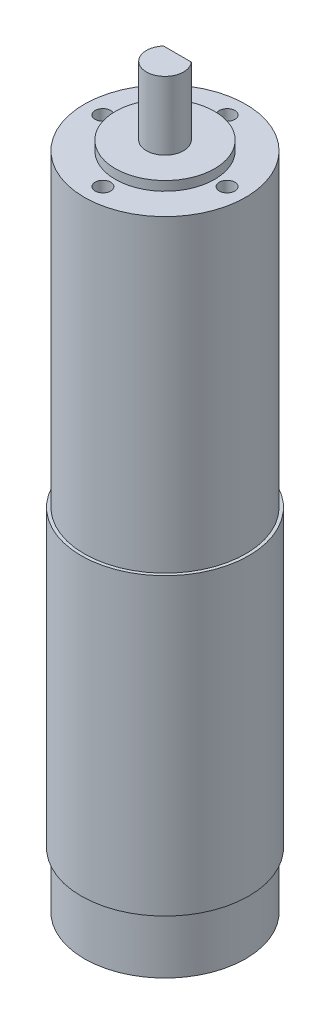
ISO-10303-21;
HEADER;
FILE_DESCRIPTION(('STEP AP214'),'2;1');
FILE_NAME('part.step','',(''),(''),'','','');
FILE_SCHEMA(('AUTOMOTIVE_DESIGN { 1 0 10303 214 1 1 1 1 }'));
ENDSEC;
DATA;
#1=APPLICATION_CONTEXT('core data for automotive mechanical design processes');
#2=APPLICATION_PROTOCOL_DEFINITION('international standard','automotive_design',2000,#1);
#3=PRODUCT_CONTEXT('',#1,'mechanical');
#4=PRODUCT('Part','Part','',(#3));
#5=PRODUCT_RELATED_PRODUCT_CATEGORY('part','',(#4));
#6=PRODUCT_DEFINITION_FORMATION('','',#4);
#7=PRODUCT_DEFINITION_CONTEXT('part definition',#1,'design');
#8=PRODUCT_DEFINITION('design','',#6,#7);
#9=PRODUCT_DEFINITION_SHAPE('','',#8);
#10=(LENGTH_UNIT() NAMED_UNIT(*) SI_UNIT(.MILLI.,.METRE.));
#11=(NAMED_UNIT(*) PLANE_ANGLE_UNIT() SI_UNIT($,.RADIAN.));
#12=(NAMED_UNIT(*) SI_UNIT($,.STERADIAN.) SOLID_ANGLE_UNIT());
#13=UNCERTAINTY_MEASURE_WITH_UNIT(LENGTH_MEASURE(1.E-05),#10,'distance_accuracy_value','');
#14=(GEOMETRIC_REPRESENTATION_CONTEXT(3) GLOBAL_UNCERTAINTY_ASSIGNED_CONTEXT((#13)) GLOBAL_UNIT_ASSIGNED_CONTEXT((#10,
#11,#12)) REPRESENTATION_CONTEXT('',''));
#15=CARTESIAN_POINT('',(0.,0.,0.));
#16=DIRECTION('',(0.,0.,1.));
#17=DIRECTION('',(1.,0.,0.));
#18=AXIS2_PLACEMENT_3D('',#15,#16,#17);
#19=CARTESIAN_POINT('',(0.,0.,0.));
#20=DIRECTION('',(0.,1.,0.));
#21=DIRECTION('',(0.,0.,1.));
#22=AXIS2_PLACEMENT_3D('',#19,#20,#21);
#23=PLANE('',#22);
#24=CARTESIAN_POINT('',(0.,0.,0.));
#25=DIRECTION('',(0.,1.,0.));
#26=DIRECTION('',(0.,0.,1.));
#27=AXIS2_PLACEMENT_3D('',#24,#25,#26);
#28=CIRCLE('',#27,27.);
#29=CARTESIAN_POINT('',(0.,0.,27.));
#30=VERTEX_POINT('',#29);
#31=EDGE_CURVE('E90',#30,#30,#28,.T.);
#32=ORIENTED_EDGE('',*,*,#31,.F.);
#33=EDGE_LOOP('',(#32));
#34=FACE_BOUND('',#33,.T.);
#35=CARTESIAN_POINT('',(0.,0.,0.));
#36=DIRECTION('',(0.,1.,0.));
#37=DIRECTION('',(0.,0.,1.));
#38=AXIS2_PLACEMENT_3D('',#35,#36,#37);
#39=CIRCLE('',#38,26.);
#40=CARTESIAN_POINT('',(0.,0.,26.));
#41=VERTEX_POINT('',#40);
#42=EDGE_CURVE('E11',#41,#41,#39,.F.);
#43=ORIENTED_EDGE('',*,*,#42,.F.);
#44=EDGE_LOOP('',(#43));
#45=FACE_BOUND('',#44,.T.);
#46=ADVANCED_FACE('F33',(#34,#45),#23,.F.);
#47=CARTESIAN_POINT('',(0.,197.5,0.));
#48=DIRECTION('',(0.,1.,0.));
#49=DIRECTION('',(0.,0.,1.));
#50=AXIS2_PLACEMENT_3D('',#47,#48,#49);
#51=PLANE('',#50);
#52=CARTESIAN_POINT('',(0.,197.5,0.));
#53=DIRECTION('',(0.,1.,0.));
#54=DIRECTION('',(0.,0.,1.));
#55=AXIS2_PLACEMENT_3D('',#52,#53,#54);
#56=CIRCLE('',#55,16.);
#57=CARTESIAN_POINT('',(0.,197.5,16.));
#58=VERTEX_POINT('',#57);
#59=EDGE_CURVE('E78',#58,#58,#56,.T.);
#60=ORIENTED_EDGE('',*,*,#59,.T.);
#61=EDGE_LOOP('',(#60));
#62=FACE_BOUND('',#61,.T.);
#63=CARTESIAN_POINT('',(0.,197.5,0.));
#64=DIRECTION('',(0.,1.,0.));
#65=DIRECTION('',(0.,0.,1.));
#66=AXIS2_PLACEMENT_3D('',#63,#64,#65);
#67=CIRCLE('',#66,6.);
#68=CARTESIAN_POINT('',(0.,197.5,6.));
#69=VERTEX_POINT('',#68);
#70=EDGE_CURVE('E72',#69,#69,#67,.T.);
#71=ORIENTED_EDGE('',*,*,#70,.F.);
#72=EDGE_LOOP('',(#71));
#73=FACE_BOUND('',#72,.T.);
#74=ADVANCED_FACE('F100',(#62,#73),#51,.T.);
#75=CARTESIAN_POINT('',(0.,194.5,0.));
#76=DIRECTION('',(0.,1.,0.));
#77=DIRECTION('',(0.,0.,1.));
#78=AXIS2_PLACEMENT_3D('',#75,#76,#77);
#79=PLANE('',#78);
#80=CARTESIAN_POINT('',(20.,194.5,0.));
#81=DIRECTION('',(0.,1.,0.));
#82=DIRECTION('',(0.,0.,1.));
#83=AXIS2_PLACEMENT_3D('',#80,#81,#82);
#84=CIRCLE('',#83,2.5);
#85=CARTESIAN_POINT('',(20.,194.5,2.5));
#86=VERTEX_POINT('',#85);
#87=EDGE_CURVE('E315',#86,#86,#84,.T.);
#88=ORIENTED_EDGE('',*,*,#87,.F.);
#89=EDGE_LOOP('',(#88));
#90=FACE_BOUND('',#89,.T.);
#91=CARTESIAN_POINT('',(0.,194.5,20.));
#92=DIRECTION('',(0.,1.,0.));
#93=DIRECTION('',(0.,0.,1.));
#94=AXIS2_PLACEMENT_3D('',#91,#92,#93);
#95=CIRCLE('',#94,2.5);
#96=CARTESIAN_POINT('',(0.,194.5,22.5));
#97=VERTEX_POINT('',#96);
#98=EDGE_CURVE('E319',#97,#97,#95,.T.);
#99=ORIENTED_EDGE('',*,*,#98,.F.);
#100=EDGE_LOOP('',(#99));
#101=FACE_BOUND('',#100,.T.);
#102=CARTESIAN_POINT('',(-20.,194.5,0.));
#103=DIRECTION('',(0.,1.,0.));
#104=DIRECTION('',(0.,0.,1.));
#105=AXIS2_PLACEMENT_3D('',#102,#103,#104);
#106=CIRCLE('',#105,2.5);
#107=CARTESIAN_POINT('',(-20.,194.5,2.5));
#108=VERTEX_POINT('',#107);
#109=EDGE_CURVE('E323',#108,#108,#106,.T.);
#110=ORIENTED_EDGE('',*,*,#109,.F.);
#111=EDGE_LOOP('',(#110));
#112=FACE_BOUND('',#111,.T.);
#113=CARTESIAN_POINT('',(0.,194.5,-20.));
#114=DIRECTION('',(0.,1.,0.));
#115=DIRECTION('',(0.,0.,1.));
#116=AXIS2_PLACEMENT_3D('',#113,#114,#115);
#117=CIRCLE('',#116,2.5);
#118=CARTESIAN_POINT('',(0.,194.5,-17.5));
#119=VERTEX_POINT('',#118);
#120=EDGE_CURVE('E326',#119,#119,#117,.T.);
#121=ORIENTED_EDGE('',*,*,#120,.F.);
#122=EDGE_LOOP('',(#121));
#123=FACE_BOUND('',#122,.T.);
#124=CARTESIAN_POINT('',(0.,194.5,0.));
#125=DIRECTION('',(0.,1.,0.));
#126=DIRECTION('',(0.,0.,1.));
#127=AXIS2_PLACEMENT_3D('',#124,#125,#126);
#128=CIRCLE('',#127,26.);
#129=CARTESIAN_POINT('',(0.,194.5,26.));
#130=VERTEX_POINT('',#129);
#131=EDGE_CURVE('E87',#130,#130,#128,.T.);
#132=ORIENTED_EDGE('',*,*,#131,.T.);
#133=EDGE_LOOP('',(#132));
#134=FACE_BOUND('',#133,.T.);
#135=CARTESIAN_POINT('',(0.,194.5,0.));
#136=DIRECTION('',(0.,1.,0.));
#137=DIRECTION('',(0.,0.,1.));
#138=AXIS2_PLACEMENT_3D('',#135,#136,#137);
#139=CIRCLE('',#138,16.);
#140=CARTESIAN_POINT('',(0.,194.5,16.));
#141=VERTEX_POINT('',#140);
#142=EDGE_CURVE('E75',#141,#141,#139,.T.);
#143=ORIENTED_EDGE('',*,*,#142,.F.);
#144=EDGE_LOOP('',(#143));
#145=FACE_BOUND('',#144,.T.);
#146=ADVANCED_FACE('F160',(#90,#101,#112,#123,#134,#145),#79,.T.);
#147=CARTESIAN_POINT('',(0.,95.,0.));
#148=DIRECTION('',(0.,1.,0.));
#149=DIRECTION('',(0.,0.,1.));
#150=AXIS2_PLACEMENT_3D('',#147,#148,#149);
#151=PLANE('',#150);
#152=CARTESIAN_POINT('',(0.,95.,0.));
#153=DIRECTION('',(0.,1.,0.));
#154=DIRECTION('',(0.,0.,1.));
#155=AXIS2_PLACEMENT_3D('',#152,#153,#154);
#156=CIRCLE('',#155,27.);
#157=CARTESIAN_POINT('',(0.,95.,27.));
#158=VERTEX_POINT('',#157);
#159=EDGE_CURVE('E41',#158,#158,#156,.T.);
#160=ORIENTED_EDGE('',*,*,#159,.T.);
#161=EDGE_LOOP('',(#160));
#162=FACE_BOUND('',#161,.T.);
#163=CARTESIAN_POINT('',(0.,95.,0.));
#164=DIRECTION('',(0.,1.,0.));
#165=DIRECTION('',(0.,0.,1.));
#166=AXIS2_PLACEMENT_3D('',#163,#164,#165);
#167=CIRCLE('',#166,26.);
#168=CARTESIAN_POINT('',(0.,95.,26.));
#169=VERTEX_POINT('',#168);
#170=EDGE_CURVE('E85',#169,#169,#167,.T.);
#171=ORIENTED_EDGE('',*,*,#170,.F.);
#172=EDGE_LOOP('',(#171));
#173=FACE_BOUND('',#172,.T.);
#174=ADVANCED_FACE('F168',(#162,#173),#151,.T.);
#175=CARTESIAN_POINT('',(0.,95.,0.));
#176=DIRECTION('',(0.,-1.,0.));
#177=DIRECTION('',(0.,0.,-1.));
#178=AXIS2_PLACEMENT_3D('',#175,#176,#177);
#179=CYLINDRICAL_SURFACE('',#178,27.);
#180=ORIENTED_EDGE('',*,*,#159,.F.);
#181=EDGE_LOOP('',(#180));
#182=FACE_BOUND('',#181,.T.);
#183=ORIENTED_EDGE('',*,*,#31,.T.);
#184=EDGE_LOOP('',(#183));
#185=FACE_BOUND('',#184,.T.);
#186=ADVANCED_FACE('F35',(#182,#185),#179,.T.);
#187=CARTESIAN_POINT('',(0.,194.5,0.));
#188=DIRECTION('',(0.,-1.,0.));
#189=DIRECTION('',(0.,0.,-1.));
#190=AXIS2_PLACEMENT_3D('',#187,#188,#189);
#191=CYLINDRICAL_SURFACE('',#190,26.);
#192=ORIENTED_EDGE('',*,*,#131,.F.);
#193=EDGE_LOOP('',(#192));
#194=FACE_BOUND('',#193,.T.);
#195=ORIENTED_EDGE('',*,*,#170,.T.);
#196=EDGE_LOOP('',(#195));
#197=FACE_BOUND('',#196,.T.);
#198=ADVANCED_FACE('F164',(#194,#197),#191,.T.);
#199=CARTESIAN_POINT('',(0.,197.5,0.));
#200=DIRECTION('',(0.,-1.,0.));
#201=DIRECTION('',(0.,0.,-1.));
#202=AXIS2_PLACEMENT_3D('',#199,#200,#201);
#203=CYLINDRICAL_SURFACE('',#202,16.);
#204=ORIENTED_EDGE('',*,*,#59,.F.);
#205=EDGE_LOOP('',(#204));
#206=FACE_BOUND('',#205,.T.);
#207=ORIENTED_EDGE('',*,*,#142,.T.);
#208=EDGE_LOOP('',(#207));
#209=FACE_BOUND('',#208,.T.);
#210=ADVANCED_FACE('F157',(#206,#209),#203,.T.);
#211=CARTESIAN_POINT('',(0.,219.5,0.));
#212=DIRECTION('',(0.,-1.,0.));
#213=DIRECTION('',(0.,0.,-1.));
#214=AXIS2_PLACEMENT_3D('',#211,#212,#213);
#215=CYLINDRICAL_SURFACE('',#214,6.);
#216=CARTESIAN_POINT('',(0.,219.5,0.));
#217=DIRECTION('',(0.,1.,0.));
#218=DIRECTION('',(0.,0.,1.));
#219=AXIS2_PLACEMENT_3D('',#216,#217,#218);
#220=CIRCLE('',#219,6.);
#221=CARTESIAN_POINT('',(-4.47213595499958,219.5,-4.));
#222=VERTEX_POINT('',#221);
#223=CARTESIAN_POINT('',(4.47213595499958,219.5,-4.));
#224=VERTEX_POINT('',#223);
#225=EDGE_CURVE('E71',#222,#224,#220,.T.);
#226=ORIENTED_EDGE('',*,*,#225,.F.);
#227=DIRECTION('',(0.,1.,0.));
#228=VECTOR('',#227,1.);
#229=CARTESIAN_POINT('',(-4.47213595499958,204.5,-4.));
#230=LINE('',#229,#228);
#231=CARTESIAN_POINT('',(-4.47213595499958,204.5,-4.));
#232=VERTEX_POINT('',#231);
#233=EDGE_CURVE('E48',#232,#222,#230,.T.);
#234=ORIENTED_EDGE('',*,*,#233,.F.);
#235=CARTESIAN_POINT('',(0.,204.5,0.));
#236=DIRECTION('',(0.,1.,0.));
#237=DIRECTION('',(0.,0.,1.));
#238=AXIS2_PLACEMENT_3D('',#235,#236,#237);
#239=CIRCLE('',#238,6.);
#240=CARTESIAN_POINT('',(4.47213595499958,204.5,-4.));
#241=VERTEX_POINT('',#240);
#242=EDGE_CURVE('E64',#241,#232,#239,.T.);
#243=ORIENTED_EDGE('',*,*,#242,.F.);
#244=DIRECTION('',(0.,1.,0.));
#245=VECTOR('',#244,1.);
#246=CARTESIAN_POINT('',(4.47213595499958,204.5,-4.));
#247=LINE('',#246,#245);
#248=EDGE_CURVE('E54',#241,#224,#247,.T.);
#249=ORIENTED_EDGE('',*,*,#248,.T.);
#250=EDGE_LOOP('',(#226,#234,#243,#249));
#251=FACE_BOUND('',#250,.T.);
#252=ORIENTED_EDGE('',*,*,#70,.T.);
#253=EDGE_LOOP('',(#252));
#254=FACE_BOUND('',#253,.T.);
#255=ADVANCED_FACE('F69',(#251,#254),#215,.T.);
#256=CARTESIAN_POINT('',(0.,219.5,0.));
#257=DIRECTION('',(0.,1.,0.));
#258=DIRECTION('',(0.,0.,1.));
#259=AXIS2_PLACEMENT_3D('',#256,#257,#258);
#260=PLANE('',#259);
#261=DIRECTION('',(1.,0.,0.));
#262=VECTOR('',#261,1.);
#263=CARTESIAN_POINT('',(-4.47213595499958,219.5,-4.));
#264=LINE('',#263,#262);
#265=EDGE_CURVE('E59',#222,#224,#264,.T.);
#266=ORIENTED_EDGE('',*,*,#265,.F.);
#267=ORIENTED_EDGE('',*,*,#225,.T.);
#268=EDGE_LOOP('',(#266,#267));
#269=FACE_BOUND('',#268,.T.);
#270=ADVANCED_FACE('F74',(#269),#260,.T.);
#271=CARTESIAN_POINT('',(-4.47213595499958,204.5,-4.));
#272=DIRECTION('',(0.,0.,1.));
#273=DIRECTION('',(1.,0.,0.));
#274=AXIS2_PLACEMENT_3D('',#271,#272,#273);
#275=PLANE('',#274);
#276=ORIENTED_EDGE('',*,*,#265,.T.);
#277=ORIENTED_EDGE('',*,*,#248,.F.);
#278=DIRECTION('',(1.,0.,0.));
#279=VECTOR('',#278,1.);
#280=CARTESIAN_POINT('',(-4.47213595499958,204.5,-4.));
#281=LINE('',#280,#279);
#282=EDGE_CURVE('E337',#232,#241,#281,.T.);
#283=ORIENTED_EDGE('',*,*,#282,.F.);
#284=ORIENTED_EDGE('',*,*,#233,.T.);
#285=EDGE_LOOP('',(#276,#277,#283,#284));
#286=FACE_BOUND('',#285,.T.);
#287=ADVANCED_FACE('F60',(#286),#275,.F.);
#288=CARTESIAN_POINT('',(0.,204.5,0.));
#289=DIRECTION('',(0.,1.,0.));
#290=DIRECTION('',(0.,0.,1.));
#291=AXIS2_PLACEMENT_3D('',#288,#289,#290);
#292=PLANE('',#291);
#293=ORIENTED_EDGE('',*,*,#242,.T.);
#294=ORIENTED_EDGE('',*,*,#282,.T.);
#295=EDGE_LOOP('',(#293,#294));
#296=FACE_BOUND('',#295,.T.);
#297=ADVANCED_FACE('F146',(#296),#292,.T.);
#298=CARTESIAN_POINT('',(0.,184.5,-20.));
#299=DIRECTION('',(0.,1.,0.));
#300=DIRECTION('',(0.,0.,1.));
#301=AXIS2_PLACEMENT_3D('',#298,#299,#300);
#302=CYLINDRICAL_SURFACE('',#301,2.5);
#303=CARTESIAN_POINT('',(0.,184.5,-20.));
#304=DIRECTION('',(0.,1.,0.));
#305=DIRECTION('',(0.,0.,1.));
#306=AXIS2_PLACEMENT_3D('',#303,#304,#305);
#307=CIRCLE('',#306,2.5);
#308=CARTESIAN_POINT('',(0.,184.5,-17.5));
#309=VERTEX_POINT('',#308);
#310=EDGE_CURVE('E65',#309,#309,#307,.T.);
#311=ORIENTED_EDGE('',*,*,#310,.F.);
#312=EDGE_LOOP('',(#311));
#313=FACE_BOUND('',#312,.T.);
#314=ORIENTED_EDGE('',*,*,#120,.T.);
#315=EDGE_LOOP('',(#314));
#316=FACE_BOUND('',#315,.T.);
#317=ADVANCED_FACE('F142',(#313,#316),#302,.F.);
#318=CARTESIAN_POINT('',(0.,184.5,-20.));
#319=DIRECTION('',(0.,1.,0.));
#320=DIRECTION('',(0.,0.,1.));
#321=AXIS2_PLACEMENT_3D('',#318,#319,#320);
#322=PLANE('',#321);
#323=ORIENTED_EDGE('',*,*,#310,.T.);
#324=EDGE_LOOP('',(#323));
#325=FACE_BOUND('',#324,.T.);
#326=ADVANCED_FACE('F138',(#325),#322,.T.);
#327=CARTESIAN_POINT('',(-20.,184.5,0.));
#328=DIRECTION('',(0.,1.,0.));
#329=DIRECTION('',(0.,0.,1.));
#330=AXIS2_PLACEMENT_3D('',#327,#328,#329);
#331=CYLINDRICAL_SURFACE('',#330,2.5);
#332=CARTESIAN_POINT('',(-20.,184.5,0.));
#333=DIRECTION('',(0.,1.,0.));
#334=DIRECTION('',(0.,0.,1.));
#335=AXIS2_PLACEMENT_3D('',#332,#333,#334);
#336=CIRCLE('',#335,2.5);
#337=CARTESIAN_POINT('',(-20.,184.5,2.5));
#338=VERTEX_POINT('',#337);
#339=EDGE_CURVE('E328',#338,#338,#336,.T.);
#340=ORIENTED_EDGE('',*,*,#339,.F.);
#341=EDGE_LOOP('',(#340));
#342=FACE_BOUND('',#341,.T.);
#343=ORIENTED_EDGE('',*,*,#109,.T.);
#344=EDGE_LOOP('',(#343));
#345=FACE_BOUND('',#344,.T.);
#346=ADVANCED_FACE('F134',(#342,#345),#331,.F.);
#347=CARTESIAN_POINT('',(-20.,184.5,0.));
#348=DIRECTION('',(0.,1.,0.));
#349=DIRECTION('',(0.,0.,1.));
#350=AXIS2_PLACEMENT_3D('',#347,#348,#349);
#351=PLANE('',#350);
#352=ORIENTED_EDGE('',*,*,#339,.T.);
#353=EDGE_LOOP('',(#352));
#354=FACE_BOUND('',#353,.T.);
#355=ADVANCED_FACE('F130',(#354),#351,.T.);
#356=CARTESIAN_POINT('',(0.,184.5,20.));
#357=DIRECTION('',(0.,1.,0.));
#358=DIRECTION('',(0.,0.,1.));
#359=AXIS2_PLACEMENT_3D('',#356,#357,#358);
#360=CYLINDRICAL_SURFACE('',#359,2.5);
#361=CARTESIAN_POINT('',(0.,184.5,20.));
#362=DIRECTION('',(0.,1.,0.));
#363=DIRECTION('',(0.,0.,1.));
#364=AXIS2_PLACEMENT_3D('',#361,#362,#363);
#365=CIRCLE('',#364,2.5);
#366=CARTESIAN_POINT('',(0.,184.5,22.5));
#367=VERTEX_POINT('',#366);
#368=EDGE_CURVE('E338',#367,#367,#365,.T.);
#369=ORIENTED_EDGE('',*,*,#368,.F.);
#370=EDGE_LOOP('',(#369));
#371=FACE_BOUND('',#370,.T.);
#372=ORIENTED_EDGE('',*,*,#98,.T.);
#373=EDGE_LOOP('',(#372));
#374=FACE_BOUND('',#373,.T.);
#375=ADVANCED_FACE('F126',(#371,#374),#360,.F.);
#376=CARTESIAN_POINT('',(0.,184.5,20.));
#377=DIRECTION('',(0.,1.,0.));
#378=DIRECTION('',(0.,0.,1.));
#379=AXIS2_PLACEMENT_3D('',#376,#377,#378);
#380=PLANE('',#379);
#381=ORIENTED_EDGE('',*,*,#368,.T.);
#382=EDGE_LOOP('',(#381));
#383=FACE_BOUND('',#382,.T.);
#384=ADVANCED_FACE('F122',(#383),#380,.T.);
#385=CARTESIAN_POINT('',(20.,184.5,0.));
#386=DIRECTION('',(0.,1.,0.));
#387=DIRECTION('',(0.,0.,1.));
#388=AXIS2_PLACEMENT_3D('',#385,#386,#387);
#389=CYLINDRICAL_SURFACE('',#388,2.5);
#390=CARTESIAN_POINT('',(20.,184.5,0.));
#391=DIRECTION('',(0.,1.,0.));
#392=DIRECTION('',(0.,0.,1.));
#393=AXIS2_PLACEMENT_3D('',#390,#391,#392);
#394=CIRCLE('',#393,2.5);
#395=CARTESIAN_POINT('',(20.,184.5,2.5));
#396=VERTEX_POINT('',#395);
#397=EDGE_CURVE('E341',#396,#396,#394,.T.);
#398=ORIENTED_EDGE('',*,*,#397,.F.);
#399=EDGE_LOOP('',(#398));
#400=FACE_BOUND('',#399,.T.);
#401=ORIENTED_EDGE('',*,*,#87,.T.);
#402=EDGE_LOOP('',(#401));
#403=FACE_BOUND('',#402,.T.);
#404=ADVANCED_FACE('F115',(#400,#403),#389,.F.);
#405=CARTESIAN_POINT('',(20.,184.5,0.));
#406=DIRECTION('',(0.,1.,0.));
#407=DIRECTION('',(0.,0.,1.));
#408=AXIS2_PLACEMENT_3D('',#405,#406,#407);
#409=PLANE('',#408);
#410=ORIENTED_EDGE('',*,*,#397,.T.);
#411=EDGE_LOOP('',(#410));
#412=FACE_BOUND('',#411,.T.);
#413=ADVANCED_FACE('F106',(#412),#409,.T.);
#414=CARTESIAN_POINT('',(0.,-18.,0.));
#415=DIRECTION('',(0.,1.,0.));
#416=DIRECTION('',(0.,0.,1.));
#417=AXIS2_PLACEMENT_3D('',#414,#415,#416);
#418=CYLINDRICAL_SURFACE('',#417,26.);
#419=CARTESIAN_POINT('',(0.,-18.,0.));
#420=DIRECTION('',(0.,-1.,0.));
#421=DIRECTION('',(0.,0.,-1.));
#422=AXIS2_PLACEMENT_3D('',#419,#420,#421);
#423=CIRCLE('',#422,26.);
#424=CARTESIAN_POINT('',(0.,-18.,-26.));
#425=VERTEX_POINT('',#424);
#426=EDGE_CURVE('E345',#425,#425,#423,.T.);
#427=ORIENTED_EDGE('',*,*,#426,.F.);
#428=EDGE_LOOP('',(#427));
#429=FACE_BOUND('',#428,.T.);
#430=ORIENTED_EDGE('',*,*,#42,.T.);
#431=EDGE_LOOP('',(#430));
#432=FACE_BOUND('',#431,.T.);
#433=ADVANCED_FACE('F103',(#429,#432),#418,.T.);
#434=CARTESIAN_POINT('',(0.,-18.,0.));
#435=DIRECTION('',(0.,-1.,0.));
#436=DIRECTION('',(0.,0.,-1.));
#437=AXIS2_PLACEMENT_3D('',#434,#435,#436);
#438=PLANE('',#437);
#439=ORIENTED_EDGE('',*,*,#426,.T.);
#440=EDGE_LOOP('',(#439));
#441=FACE_BOUND('',#440,.T.);
#442=ADVANCED_FACE('F105',(#441),#438,.T.);
#443=CLOSED_SHELL('',(#46,#74,#146,#174,#186,#198,#210,#255,#270,#287,#297,#317,#326,#346,#355,
#375,#384,#404,#413,#433,#442));
#444=MANIFOLD_SOLID_BREP('B2',#443);
#445=ADVANCED_BREP_SHAPE_REPRESENTATION('',(#18,#444),#14);
#446=SHAPE_DEFINITION_REPRESENTATION(#9,#445);
ENDSEC;
END-ISO-10303-21;
